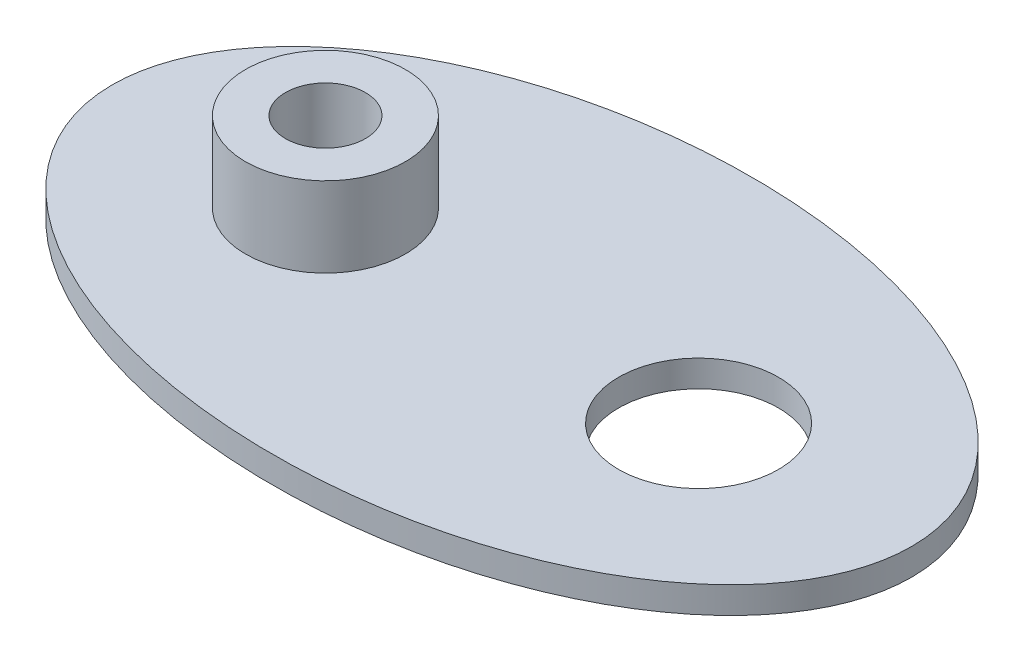
ISO-10303-21;
HEADER;
FILE_DESCRIPTION(('STEP AP214'),'2;1');
FILE_NAME('part.step','',(''),(''),'','','');
FILE_SCHEMA(('AUTOMOTIVE_DESIGN { 1 0 10303 214 1 1 1 1 }'));
ENDSEC;
DATA;
#1=APPLICATION_CONTEXT('core data for automotive mechanical design processes');
#2=APPLICATION_PROTOCOL_DEFINITION('international standard','automotive_design',2000,#1);
#3=PRODUCT_CONTEXT('',#1,'mechanical');
#4=PRODUCT('Part','Part','',(#3));
#5=PRODUCT_RELATED_PRODUCT_CATEGORY('part','',(#4));
#6=PRODUCT_DEFINITION_FORMATION('','',#4);
#7=PRODUCT_DEFINITION_CONTEXT('part definition',#1,'design');
#8=PRODUCT_DEFINITION('design','',#6,#7);
#9=PRODUCT_DEFINITION_SHAPE('','',#8);
#10=(LENGTH_UNIT() NAMED_UNIT(*) SI_UNIT(.MILLI.,.METRE.));
#11=(NAMED_UNIT(*) PLANE_ANGLE_UNIT() SI_UNIT($,.RADIAN.));
#12=(NAMED_UNIT(*) SI_UNIT($,.STERADIAN.) SOLID_ANGLE_UNIT());
#13=UNCERTAINTY_MEASURE_WITH_UNIT(LENGTH_MEASURE(1.E-05),#10,'distance_accuracy_value','');
#14=(GEOMETRIC_REPRESENTATION_CONTEXT(3) GLOBAL_UNCERTAINTY_ASSIGNED_CONTEXT((#13)) GLOBAL_UNIT_ASSIGNED_CONTEXT((#10,
#11,#12)) REPRESENTATION_CONTEXT('',''));
#15=CARTESIAN_POINT('',(0.,0.,0.));
#16=DIRECTION('',(0.,0.,1.));
#17=DIRECTION('',(1.,0.,0.));
#18=AXIS2_PLACEMENT_3D('',#15,#16,#17);
#19=CARTESIAN_POINT('',(-7.,4.,0.));
#20=DIRECTION('',(0.,1.,0.));
#21=DIRECTION('',(0.,0.,1.));
#22=AXIS2_PLACEMENT_3D('',#19,#20,#21);
#23=PLANE('',#22);
#24=CARTESIAN_POINT('',(-7.,4.,0.));
#25=DIRECTION('',(0.,1.,0.));
#26=DIRECTION('',(0.,0.,1.));
#27=AXIS2_PLACEMENT_3D('',#24,#25,#26);
#28=CIRCLE('',#27,3.);
#29=CARTESIAN_POINT('',(-7.,4.,3.));
#30=VERTEX_POINT('',#29);
#31=EDGE_CURVE('E11',#30,#30,#28,.T.);
#32=ORIENTED_EDGE('',*,*,#31,.T.);
#33=EDGE_LOOP('',(#32));
#34=FACE_BOUND('',#33,.T.);
#35=CARTESIAN_POINT('',(-7.,4.,0.));
#36=DIRECTION('',(0.,1.,0.));
#37=DIRECTION('',(0.,0.,1.));
#38=AXIS2_PLACEMENT_3D('',#35,#36,#37);
#39=CIRCLE('',#38,1.5);
#40=CARTESIAN_POINT('',(-7.,4.,1.5));
#41=VERTEX_POINT('',#40);
#42=EDGE_CURVE('E52',#41,#41,#39,.T.);
#43=ORIENTED_EDGE('',*,*,#42,.F.);
#44=EDGE_LOOP('',(#43));
#45=FACE_BOUND('',#44,.T.);
#46=ADVANCED_FACE('F41',(#34,#45),#23,.T.);
#47=CARTESIAN_POINT('',(-7.,1.,0.));
#48=DIRECTION('',(0.,1.,0.));
#49=DIRECTION('',(0.,0.,1.));
#50=AXIS2_PLACEMENT_3D('',#47,#48,#49);
#51=PLANE('',#50);
#52=CARTESIAN_POINT('',(-7.,1.,0.));
#53=DIRECTION('',(0.,1.,0.));
#54=DIRECTION('',(0.,0.,1.));
#55=AXIS2_PLACEMENT_3D('',#52,#53,#54);
#56=CIRCLE('',#55,3.);
#57=CARTESIAN_POINT('',(-7.,1.,3.));
#58=VERTEX_POINT('',#57);
#59=EDGE_CURVE('E45',#58,#58,#56,.T.);
#60=ORIENTED_EDGE('',*,*,#59,.F.);
#61=EDGE_LOOP('',(#60));
#62=FACE_BOUND('',#61,.T.);
#63=CARTESIAN_POINT('',(-7.,1.,0.));
#64=DIRECTION('',(0.,1.,0.));
#65=DIRECTION('',(0.,0.,1.));
#66=AXIS2_PLACEMENT_3D('',#63,#64,#65);
#67=CIRCLE('',#66,1.5);
#68=CARTESIAN_POINT('',(-7.,1.,1.5));
#69=VERTEX_POINT('',#68);
#70=EDGE_CURVE('E54',#69,#69,#67,.T.);
#71=ORIENTED_EDGE('',*,*,#70,.T.);
#72=EDGE_LOOP('',(#71));
#73=FACE_BOUND('',#72,.T.);
#74=ADVANCED_FACE('F64',(#62,#73),#51,.F.);
#75=CARTESIAN_POINT('',(-7.,4.,0.));
#76=DIRECTION('',(0.,-1.,0.));
#77=DIRECTION('',(0.,0.,-1.));
#78=AXIS2_PLACEMENT_3D('',#75,#76,#77);
#79=CYLINDRICAL_SURFACE('',#78,3.);
#80=ORIENTED_EDGE('',*,*,#31,.F.);
#81=EDGE_LOOP('',(#80));
#82=FACE_BOUND('',#81,.T.);
#83=ORIENTED_EDGE('',*,*,#59,.T.);
#84=EDGE_LOOP('',(#83));
#85=FACE_BOUND('',#84,.T.);
#86=ADVANCED_FACE('F43',(#82,#85),#79,.T.);
#87=CARTESIAN_POINT('',(-7.,4.,0.));
#88=DIRECTION('',(0.,-1.,0.));
#89=DIRECTION('',(0.,0.,-1.));
#90=AXIS2_PLACEMENT_3D('',#87,#88,#89);
#91=CYLINDRICAL_SURFACE('',#90,1.5);
#92=ORIENTED_EDGE('',*,*,#42,.T.);
#93=EDGE_LOOP('',(#92));
#94=FACE_BOUND('',#93,.T.);
#95=ORIENTED_EDGE('',*,*,#70,.F.);
#96=EDGE_LOOP('',(#95));
#97=FACE_BOUND('',#96,.T.);
#98=ADVANCED_FACE('F60',(#94,#97),#91,.F.);
#99=CLOSED_SHELL('',(#46,#74,#86,#98));
#100=MANIFOLD_SOLID_BREP('B2',#99);
#101=CARTESIAN_POINT('',(0.,1.,0.));
#102=DIRECTION('',(0.,1.,0.));
#103=DIRECTION('',(0.,0.,1.));
#104=AXIS2_PLACEMENT_3D('',#101,#102,#103);
#105=PLANE('',#104);
#106=CARTESIAN_POINT('',(-7.,1.,0.));
#107=DIRECTION('',(0.,1.,0.));
#108=DIRECTION('',(0.,0.,1.));
#109=AXIS2_PLACEMENT_3D('',#106,#107,#108);
#110=CIRCLE('',#109,3.);
#111=CARTESIAN_POINT('',(-7.,1.,3.));
#112=VERTEX_POINT('',#111);
#113=EDGE_CURVE('E114',#112,#112,#110,.T.);
#114=ORIENTED_EDGE('',*,*,#113,.F.);
#115=EDGE_LOOP('',(#114));
#116=FACE_BOUND('',#115,.T.);
#117=CARTESIAN_POINT('',(0.,1.,0.));
#118=DIRECTION('',(0.,1.,0.));
#119=DIRECTION('',(-1.,0.,0.));
#120=AXIS2_PLACEMENT_3D('',#117,#118,#119);
#121=ELLIPSE('',#120,15.,9.);
#122=CARTESIAN_POINT('',(-15.,1.,0.));
#123=VERTEX_POINT('',#122);
#124=EDGE_CURVE('E40',#123,#123,#121,.T.);
#125=ORIENTED_EDGE('',*,*,#124,.T.);
#126=EDGE_LOOP('',(#125));
#127=FACE_BOUND('',#126,.T.);
#128=CARTESIAN_POINT('',(7.,1.,0.));
#129=DIRECTION('',(0.,1.,0.));
#130=DIRECTION('',(0.,0.,1.));
#131=AXIS2_PLACEMENT_3D('',#128,#129,#130);
#132=CIRCLE('',#131,3.);
#133=CARTESIAN_POINT('',(7.,1.,3.));
#134=VERTEX_POINT('',#133);
#135=EDGE_CURVE('E120',#134,#134,#132,.T.);
#136=ORIENTED_EDGE('',*,*,#135,.F.);
#137=EDGE_LOOP('',(#136));
#138=FACE_BOUND('',#137,.T.);
#139=ADVANCED_FACE('F103',(#116,#127,#138),#105,.T.);
#140=CARTESIAN_POINT('',(0.,0.,0.));
#141=DIRECTION('',(0.,1.,0.));
#142=DIRECTION('',(0.,0.,1.));
#143=AXIS2_PLACEMENT_3D('',#140,#141,#142);
#144=PLANE('',#143);
#145=CARTESIAN_POINT('',(0.,0.,0.));
#146=DIRECTION('',(0.,1.,0.));
#147=DIRECTION('',(-1.,0.,0.));
#148=AXIS2_PLACEMENT_3D('',#145,#146,#147);
#149=ELLIPSE('',#148,15.,9.);
#150=CARTESIAN_POINT('',(-15.,0.,0.));
#151=VERTEX_POINT('',#150);
#152=EDGE_CURVE('E108',#151,#151,#149,.T.);
#153=ORIENTED_EDGE('',*,*,#152,.F.);
#154=EDGE_LOOP('',(#153));
#155=FACE_BOUND('',#154,.T.);
#156=CARTESIAN_POINT('',(-7.,0.,0.));
#157=DIRECTION('',(0.,1.,0.));
#158=DIRECTION('',(0.,0.,1.));
#159=AXIS2_PLACEMENT_3D('',#156,#157,#158);
#160=CIRCLE('',#159,3.);
#161=CARTESIAN_POINT('',(-7.,0.,3.));
#162=VERTEX_POINT('',#161);
#163=EDGE_CURVE('E117',#162,#162,#160,.T.);
#164=ORIENTED_EDGE('',*,*,#163,.T.);
#165=EDGE_LOOP('',(#164));
#166=FACE_BOUND('',#165,.T.);
#167=CARTESIAN_POINT('',(7.,0.,0.));
#168=DIRECTION('',(0.,1.,0.));
#169=DIRECTION('',(0.,0.,1.));
#170=AXIS2_PLACEMENT_3D('',#167,#168,#169);
#171=CIRCLE('',#170,3.);
#172=CARTESIAN_POINT('',(7.,0.,3.));
#173=VERTEX_POINT('',#172);
#174=EDGE_CURVE('E123',#173,#173,#171,.T.);
#175=ORIENTED_EDGE('',*,*,#174,.T.);
#176=EDGE_LOOP('',(#175));
#177=FACE_BOUND('',#176,.T.);
#178=ADVANCED_FACE('F133',(#155,#166,#177),#144,.F.);
#179=DIRECTION('',(0.,-1.,0.));
#180=VECTOR('',#179,1.);
#181=SURFACE_OF_LINEAR_EXTRUSION('',#121,#180);
#182=ORIENTED_EDGE('',*,*,#124,.F.);
#183=EDGE_LOOP('',(#182));
#184=FACE_BOUND('',#183,.T.);
#185=ORIENTED_EDGE('',*,*,#152,.T.);
#186=EDGE_LOOP('',(#185));
#187=FACE_BOUND('',#186,.T.);
#188=ADVANCED_FACE('F105',(#184,#187),#181,.F.);
#189=CARTESIAN_POINT('',(-7.,1.,0.));
#190=DIRECTION('',(0.,-1.,0.));
#191=DIRECTION('',(0.,0.,-1.));
#192=AXIS2_PLACEMENT_3D('',#189,#190,#191);
#193=CYLINDRICAL_SURFACE('',#192,3.);
#194=ORIENTED_EDGE('',*,*,#113,.T.);
#195=EDGE_LOOP('',(#194));
#196=FACE_BOUND('',#195,.T.);
#197=ORIENTED_EDGE('',*,*,#163,.F.);
#198=EDGE_LOOP('',(#197));
#199=FACE_BOUND('',#198,.T.);
#200=ADVANCED_FACE('F142',(#196,#199),#193,.F.);
#201=CARTESIAN_POINT('',(7.,1.,0.));
#202=DIRECTION('',(0.,-1.,0.));
#203=DIRECTION('',(0.,0.,-1.));
#204=AXIS2_PLACEMENT_3D('',#201,#202,#203);
#205=CYLINDRICAL_SURFACE('',#204,3.);
#206=ORIENTED_EDGE('',*,*,#135,.T.);
#207=EDGE_LOOP('',(#206));
#208=FACE_BOUND('',#207,.T.);
#209=ORIENTED_EDGE('',*,*,#174,.F.);
#210=EDGE_LOOP('',(#209));
#211=FACE_BOUND('',#210,.T.);
#212=ADVANCED_FACE('F129',(#208,#211),#205,.F.);
#213=CLOSED_SHELL('',(#139,#178,#188,#200,#212));
#214=MANIFOLD_SOLID_BREP('B6',#213);
#215=ADVANCED_BREP_SHAPE_REPRESENTATION('',(#18,#100,#214),#14);
#216=SHAPE_DEFINITION_REPRESENTATION(#9,#215);
ENDSEC;
END-ISO-10303-21;
